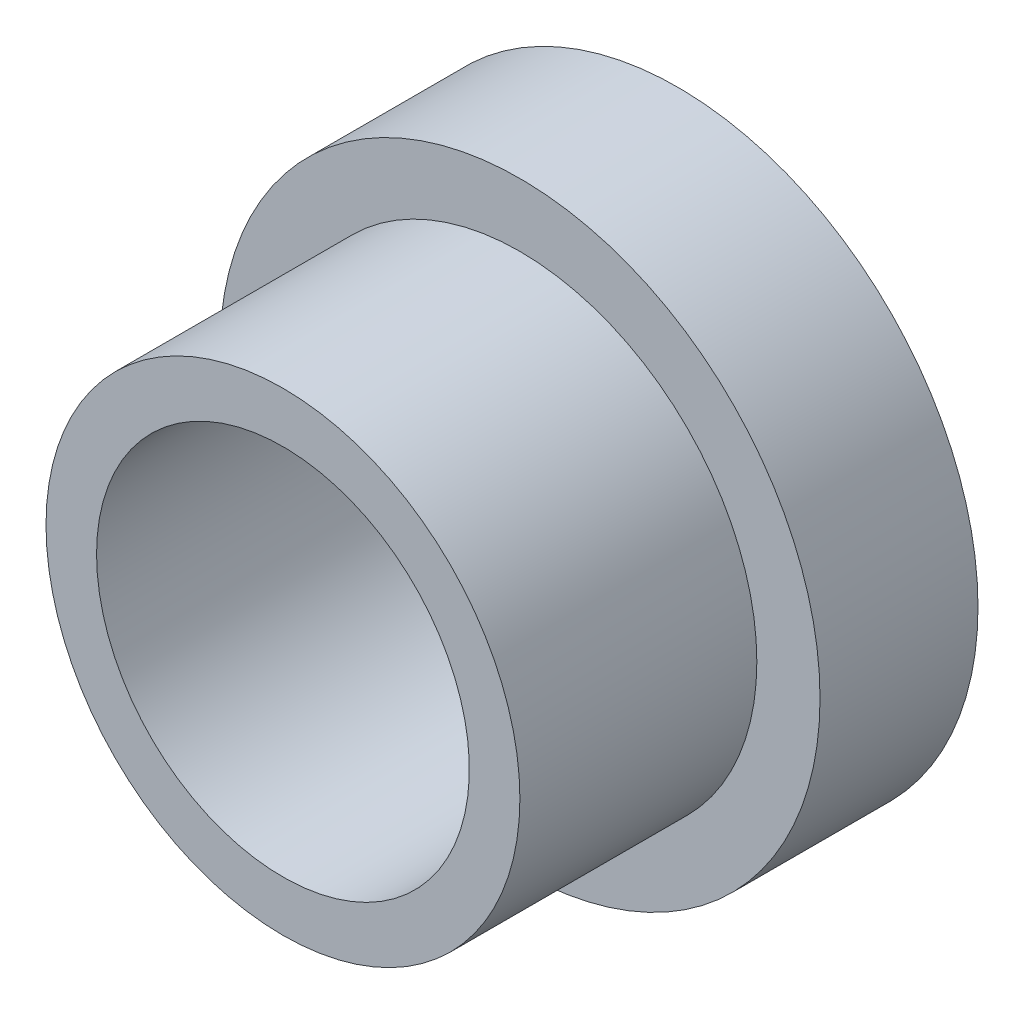
ISO-10303-21;
HEADER;
FILE_DESCRIPTION(('STEP AP214'),'2;1');
FILE_NAME('part.step','',(''),(''),'','','');
FILE_SCHEMA(('AUTOMOTIVE_DESIGN { 1 0 10303 214 1 1 1 1 }'));
ENDSEC;
DATA;
#1=APPLICATION_CONTEXT('core data for automotive mechanical design processes');
#2=APPLICATION_PROTOCOL_DEFINITION('international standard','automotive_design',2000,#1);
#3=PRODUCT_CONTEXT('',#1,'mechanical');
#4=PRODUCT('Part','Part','',(#3));
#5=PRODUCT_RELATED_PRODUCT_CATEGORY('part','',(#4));
#6=PRODUCT_DEFINITION_FORMATION('','',#4);
#7=PRODUCT_DEFINITION_CONTEXT('part definition',#1,'design');
#8=PRODUCT_DEFINITION('design','',#6,#7);
#9=PRODUCT_DEFINITION_SHAPE('','',#8);
#10=(LENGTH_UNIT() NAMED_UNIT(*) SI_UNIT(.MILLI.,.METRE.));
#11=(NAMED_UNIT(*) PLANE_ANGLE_UNIT() SI_UNIT($,.RADIAN.));
#12=(NAMED_UNIT(*) SI_UNIT($,.STERADIAN.) SOLID_ANGLE_UNIT());
#13=UNCERTAINTY_MEASURE_WITH_UNIT(LENGTH_MEASURE(1.E-05),#10,'distance_accuracy_value','');
#14=(GEOMETRIC_REPRESENTATION_CONTEXT(3) GLOBAL_UNCERTAINTY_ASSIGNED_CONTEXT((#13)) GLOBAL_UNIT_ASSIGNED_CONTEXT((#10,
#11,#12)) REPRESENTATION_CONTEXT('',''));
#15=CARTESIAN_POINT('',(0.,0.,0.));
#16=DIRECTION('',(0.,0.,1.));
#17=DIRECTION('',(1.,0.,0.));
#18=AXIS2_PLACEMENT_3D('',#15,#16,#17);
#19=CARTESIAN_POINT('',(0.,0.,6.35));
#20=DIRECTION('',(0.,0.,1.));
#21=DIRECTION('',(1.,0.,0.));
#22=AXIS2_PLACEMENT_3D('',#19,#20,#21);
#23=PLANE('',#22);
#24=CARTESIAN_POINT('',(0.,0.,6.35));
#25=DIRECTION('',(0.,0.,1.));
#26=DIRECTION('',(1.,0.,0.));
#27=AXIS2_PLACEMENT_3D('',#24,#25,#26);
#28=CIRCLE('',#27,12.065);
#29=CARTESIAN_POINT('',(12.065,0.,6.35));
#30=VERTEX_POINT('',#29);
#31=EDGE_CURVE('E10',#30,#30,#28,.T.);
#32=ORIENTED_EDGE('',*,*,#31,.T.);
#33=EDGE_LOOP('',(#32));
#34=FACE_BOUND('',#33,.T.);
#35=CARTESIAN_POINT('',(0.,0.,6.35));
#36=DIRECTION('',(0.,0.,1.));
#37=DIRECTION('',(1.,0.,0.));
#38=AXIS2_PLACEMENT_3D('',#35,#36,#37);
#39=CIRCLE('',#38,9.525);
#40=CARTESIAN_POINT('',(9.525,0.,6.35));
#41=VERTEX_POINT('',#40);
#42=EDGE_CURVE('E58',#41,#41,#39,.T.);
#43=ORIENTED_EDGE('',*,*,#42,.F.);
#44=EDGE_LOOP('',(#43));
#45=FACE_BOUND('',#44,.T.);
#46=ADVANCED_FACE('F37',(#34,#45),#23,.T.);
#47=CARTESIAN_POINT('',(0.,0.,6.35));
#48=DIRECTION('',(0.,0.,-1.));
#49=DIRECTION('',(-1.,0.,0.));
#50=AXIS2_PLACEMENT_3D('',#47,#48,#49);
#51=CYLINDRICAL_SURFACE('',#50,12.065);
#52=CARTESIAN_POINT('',(-12.065,0.,1.4478));
#53=CARTESIAN_POINT('',(-12.0649985041005,0.0964884543450404,1.44780401682392));
#54=CARTESIAN_POINT('',(-12.0638303589616,0.193034155145278,1.45591264605277));
#55=CARTESIAN_POINT('',(-12.0592828021006,0.38343047278372,1.4881267082203));
#56=CARTESIAN_POINT('',(-12.0559011918848,0.477278313162616,1.51224804589987));
#57=CARTESIAN_POINT('',(-12.0473069959825,0.65949565450108,1.57575497131468));
#58=CARTESIAN_POINT('',(-12.0420957506089,0.747869110160845,1.61512938747027));
#59=CARTESIAN_POINT('',(-12.0304192156495,0.916739911937079,1.70799827245479));
#60=CARTESIAN_POINT('',(-12.0239541121138,0.99723842389159,1.76149064685575));
#61=CARTESIAN_POINT('',(-12.0104380083644,1.14866365986144,1.8814844220945));
#62=CARTESIAN_POINT('',(-12.0033835313217,1.21952599782181,1.94806669129644));
#63=CARTESIAN_POINT('',(-11.9895112125531,1.34911212744686,2.09217627787022));
#64=CARTESIAN_POINT('',(-11.9826933839829,1.40783524516034,2.16970420252643));
#65=CARTESIAN_POINT('',(-11.970032472617,1.51172365726895,2.33393306104171));
#66=CARTESIAN_POINT('',(-11.9641938809672,1.55682720468731,2.42067343120915));
#67=CARTESIAN_POINT('',(-11.9541995874195,1.63180163908825,2.60059579968724));
#68=CARTESIAN_POINT('',(-11.950043802025,1.66167328185876,2.6937774781277));
#69=CARTESIAN_POINT('',(-11.943919604014,1.70513718284501,2.88326256195756));
#70=CARTESIAN_POINT('',(-11.9419364406316,1.71883927207584,2.97954028907811));
#71=CARTESIAN_POINT('',(-11.9403371589043,1.7299152479595,3.17304739966861));
#72=CARTESIAN_POINT('',(-11.9407209165818,1.72728998982615,3.27027673302782));
#73=CARTESIAN_POINT('',(-11.9437986235095,1.70587566350776,3.4621542738988));
#74=CARTESIAN_POINT('',(-11.9464751455298,1.68720852572685,3.55681640898697));
#75=CARTESIAN_POINT('',(-11.9538095965803,1.63443101834743,3.74165082781202));
#76=CARTESIAN_POINT('',(-11.9584675770697,1.60032024767048,3.83182299487481));
#77=CARTESIAN_POINT('',(-11.9692595113069,1.51749570954079,4.00549107394876));
#78=CARTESIAN_POINT('',(-11.9753987087908,1.46872990694117,4.08896183054549));
#79=CARTESIAN_POINT('',(-11.9884574849056,1.35801669179577,4.2465816785898));
#80=CARTESIAN_POINT('',(-11.9953771102361,1.29606849023947,4.32073021164844));
#81=CARTESIAN_POINT('',(-12.0092942198149,1.16007778385262,4.4583077862522));
#82=CARTESIAN_POINT('',(-12.0162918396414,1.08593036818556,4.52163315932482));
#83=CARTESIAN_POINT('',(-12.0295178957284,0.928004629275646,4.63495644124068));
#84=CARTESIAN_POINT('',(-12.0357463291408,0.844226270375422,4.68495430073819));
#85=CARTESIAN_POINT('',(-12.0467379261181,0.669329836206021,4.77020709183091));
#86=CARTESIAN_POINT('',(-12.0515003380949,0.578208026258997,4.80545446458137));
#87=CARTESIAN_POINT('',(-12.0590168850682,0.391255347913628,4.86011790324658));
#88=CARTESIAN_POINT('',(-12.0617711436242,0.295424769628157,4.87953494319366));
#89=CARTESIAN_POINT('',(-12.0649447800063,0.102670036805973,4.90184970451336));
#90=CARTESIAN_POINT('',(-12.0653843132238,0.00576271069349187,4.90489003088116));
#91=CARTESIAN_POINT('',(-12.0639337107159,-0.18717853030849,4.89474294385951));
#92=CARTESIAN_POINT('',(-12.0620436405075,-0.28321246968425,4.88155598683962));
#93=CARTESIAN_POINT('',(-12.0561586805947,-0.471252184740598,4.83944721921327));
#94=CARTESIAN_POINT('',(-12.0521730294487,-0.563273736163867,4.8105944546433));
#95=CARTESIAN_POINT('',(-12.0425425508097,-0.741172931556662,4.73804560812774));
#96=CARTESIAN_POINT('',(-12.0368976514939,-0.827050309367008,4.69434888362805));
#97=CARTESIAN_POINT('',(-12.0245263853715,-0.990853356151727,4.5930149061261));
#98=CARTESIAN_POINT('',(-12.0177930606412,-1.06872220577748,4.53528667128957));
#99=CARTESIAN_POINT('',(-12.0040172458003,-1.2137171924543,4.40765562531037));
#100=CARTESIAN_POINT('',(-11.9969747394169,-1.28084276320418,4.33775217279128));
#101=CARTESIAN_POINT('',(-11.9833108785997,-1.40296089013384,4.18712203681459));
#102=CARTESIAN_POINT('',(-11.9766930997437,-1.45785815430897,4.10631772561116));
#103=CARTESIAN_POINT('',(-11.9646900187645,-1.55330015810762,3.93655113452041));
#104=CARTESIAN_POINT('',(-11.9593046857287,-1.59384525773093,3.8475890593273));
#105=CARTESIAN_POINT('',(-11.9504017224073,-1.65928238165809,3.66432316993253));
#106=CARTESIAN_POINT('',(-11.9468779906908,-1.68422559150998,3.57003794145217));
#107=CARTESIAN_POINT('',(-11.9420806193532,-1.71791440391797,3.37856276993285));
#108=CARTESIAN_POINT('',(-11.940806839334,-1.72666101715085,3.28137300852297));
#109=CARTESIAN_POINT('',(-11.9406585128162,-1.72768590402545,3.0877968638374));
#110=CARTESIAN_POINT('',(-11.9417621443008,-1.72011396371325,2.99141125664726));
#111=CARTESIAN_POINT('',(-11.9461970132462,-1.6890365616241,2.80129882275977));
#112=CARTESIAN_POINT('',(-11.9495282483612,-1.66553111662558,2.70757199326276));
#113=CARTESIAN_POINT('',(-11.9580356047218,-1.60330516262919,2.52547288587834));
#114=CARTESIAN_POINT('',(-11.9632105698968,-1.5645941863711,2.43709729314934));
#115=CARTESIAN_POINT('',(-11.9748238370226,-1.47307082901084,2.26807122174957));
#116=CARTESIAN_POINT('',(-11.9812621740083,-1.42025805683243,2.18742095740478));
#117=CARTESIAN_POINT('',(-11.9947472532479,-1.30148257030631,2.03537241681569));
#118=CARTESIAN_POINT('',(-12.0017988325567,-1.23540867850348,1.9640614089024));
#119=CARTESIAN_POINT('',(-12.0156747903311,-1.09222118229823,1.83348514565739));
#120=CARTESIAN_POINT('',(-12.0224991154125,-1.01510500619472,1.7742227041876));
#121=CARTESIAN_POINT('',(-12.0351902736848,-0.851571550996564,1.66916444703717));
#122=CARTESIAN_POINT('',(-12.0410521560854,-0.765109754814756,1.62343734629982));
#123=CARTESIAN_POINT('',(-12.0511090894658,-0.585692447555416,1.54722108641448));
#124=CARTESIAN_POINT('',(-12.0553058907113,-0.492743876652405,1.51671591784832));
#125=CARTESIAN_POINT('',(-12.0605860358316,-0.332799090104946,1.47884198403685));
#126=CARTESIAN_POINT('',(-12.062232900176,-0.26679682861633,1.46721871619034));
#127=CARTESIAN_POINT('',(-12.0644403953593,-0.133872225166998,1.45169637239414));
#128=CARTESIAN_POINT('',(-12.0650010379513,-0.0669498931693692,1.44779721286931));
#129=CARTESIAN_POINT('',(-12.065,0.,1.4478));
#130=B_SPLINE_CURVE_WITH_KNOTS('',3,(#52,#53,#54,#55,#56,#57,#58,#59,#60,#61,#62,#63,#64,#65,
#66,#67,#68,#69,#70,#71,#72,#73,#74,#75,#76,#77,#78,#79,#80,#81,#82,#83,#84,#85,#86,#87,#88,#89,
#90,#91,#92,#93,#94,#95,#96,#97,#98,#99,#100,#101,#102,#103,#104,#105,#106,#107,#108,#109,#110,
#111,#112,#113,#114,#115,#116,#117,#118,#119,#120,#121,#122,#123,#124,#125,#126,#127,#128,#129),
.UNSPECIFIED.,.T.,.F.,(4,2,2,2,2,2,2,2,2,2,2,2,2,2,2,2,2,2,2,2,2,2,2,2,2,2,2,2,2,2,2,2,2,2,2,2,
2,2,4),(0.,0.289220749432823,0.578729200194767,0.868026010375867,1.15727992688445,
1.44838041330317,1.73949705684387,2.03191437504971,2.32431718246423,2.61472220997412,
2.90511202642148,3.19331398780884,3.48152343436625,3.77076855672439,4.0600309962394,
4.35192526520652,4.64382061491082,4.93586536292638,5.22789214022055,5.51737184883535,
5.8068434164259,6.09504939247946,6.38326784576508,6.67340747608099,6.96356239524336,
7.25590492530746,7.54824012193353,7.83961114565159,8.13096398704053,8.41965393294043,
8.7083435748419,8.99685251788698,9.2853694628003,9.57641468202267,9.86752779502192,
10.1600944081533,10.4523526671518,10.6530347894157,10.8537147402796),.UNSPECIFIED.);
#131=CARTESIAN_POINT('',(-12.065,0.,1.4478));
#132=VERTEX_POINT('',#131);
#133=EDGE_CURVE('E68',#132,#132,#130,.T.);
#134=ORIENTED_EDGE('',*,*,#133,.T.);
#135=EDGE_LOOP('',(#134));
#136=FACE_BOUND('',#135,.T.);
#137=ORIENTED_EDGE('',*,*,#31,.F.);
#138=EDGE_LOOP('',(#137));
#139=FACE_BOUND('',#138,.T.);
#140=CARTESIAN_POINT('',(0.,0.,0.));
#141=DIRECTION('',(0.,0.,1.));
#142=DIRECTION('',(1.,0.,0.));
#143=AXIS2_PLACEMENT_3D('',#140,#141,#142);
#144=CIRCLE('',#143,12.065);
#145=CARTESIAN_POINT('',(12.065,0.,0.));
#146=VERTEX_POINT('',#145);
#147=EDGE_CURVE('E50',#146,#146,#144,.T.);
#148=ORIENTED_EDGE('',*,*,#147,.T.);
#149=EDGE_LOOP('',(#148));
#150=FACE_BOUND('',#149,.T.);
#151=ADVANCED_FACE('F39',(#136,#139,#150),#51,.T.);
#152=CARTESIAN_POINT('',(0.,0.,0.));
#153=DIRECTION('',(0.,0.,1.));
#154=DIRECTION('',(1.,0.,0.));
#155=AXIS2_PLACEMENT_3D('',#152,#153,#154);
#156=PLANE('',#155);
#157=CARTESIAN_POINT('',(0.,0.,0.));
#158=DIRECTION('',(0.,0.,-1.));
#159=DIRECTION('',(-1.,0.,0.));
#160=AXIS2_PLACEMENT_3D('',#157,#158,#159);
#161=CIRCLE('',#160,7.493);
#162=CARTESIAN_POINT('',(-7.493,0.,0.));
#163=VERTEX_POINT('',#162);
#164=EDGE_CURVE('E64',#163,#163,#161,.T.);
#165=ORIENTED_EDGE('',*,*,#164,.F.);
#166=EDGE_LOOP('',(#165));
#167=FACE_BOUND('',#166,.T.);
#168=ORIENTED_EDGE('',*,*,#147,.F.);
#169=EDGE_LOOP('',(#168));
#170=FACE_BOUND('',#169,.T.);
#171=ADVANCED_FACE('F92',(#167,#170),#156,.F.);
#172=CARTESIAN_POINT('',(0.,0.,15.875));
#173=DIRECTION('',(0.,0.,-1.));
#174=DIRECTION('',(-1.,0.,0.));
#175=AXIS2_PLACEMENT_3D('',#172,#173,#174);
#176=CYLINDRICAL_SURFACE('',#175,9.525);
#177=CARTESIAN_POINT('',(0.,0.,15.875));
#178=DIRECTION('',(0.,0.,1.));
#179=DIRECTION('',(1.,0.,0.));
#180=AXIS2_PLACEMENT_3D('',#177,#178,#179);
#181=CIRCLE('',#180,9.525);
#182=CARTESIAN_POINT('',(9.525,0.,15.875));
#183=VERTEX_POINT('',#182);
#184=EDGE_CURVE('E56',#183,#183,#181,.T.);
#185=ORIENTED_EDGE('',*,*,#184,.F.);
#186=EDGE_LOOP('',(#185));
#187=FACE_BOUND('',#186,.T.);
#188=ORIENTED_EDGE('',*,*,#42,.T.);
#189=EDGE_LOOP('',(#188));
#190=FACE_BOUND('',#189,.T.);
#191=ADVANCED_FACE('F88',(#187,#190),#176,.T.);
#192=CARTESIAN_POINT('',(0.,0.,15.875));
#193=DIRECTION('',(0.,0.,1.));
#194=DIRECTION('',(1.,0.,0.));
#195=AXIS2_PLACEMENT_3D('',#192,#193,#194);
#196=PLANE('',#195);
#197=CARTESIAN_POINT('',(0.,0.,15.875));
#198=DIRECTION('',(0.,0.,-1.));
#199=DIRECTION('',(-1.,0.,0.));
#200=AXIS2_PLACEMENT_3D('',#197,#198,#199);
#201=CIRCLE('',#200,7.493);
#202=CARTESIAN_POINT('',(-7.493,0.,15.875));
#203=VERTEX_POINT('',#202);
#204=EDGE_CURVE('E61',#203,#203,#201,.T.);
#205=ORIENTED_EDGE('',*,*,#204,.T.);
#206=EDGE_LOOP('',(#205));
#207=FACE_BOUND('',#206,.T.);
#208=ORIENTED_EDGE('',*,*,#184,.T.);
#209=EDGE_LOOP('',(#208));
#210=FACE_BOUND('',#209,.T.);
#211=ADVANCED_FACE('F84',(#207,#210),#196,.T.);
#212=CARTESIAN_POINT('',(0.,0.,15.875));
#213=DIRECTION('',(0.,0.,-1.));
#214=DIRECTION('',(-1.,0.,0.));
#215=AXIS2_PLACEMENT_3D('',#212,#213,#214);
#216=CYLINDRICAL_SURFACE('',#215,7.493);
#217=CARTESIAN_POINT('',(-7.493,0.,4.9022));
#218=CARTESIAN_POINT('',(-7.49299826637144,0.0956624507880844,4.90219692622512));
#219=CARTESIAN_POINT('',(-7.49114954278737,0.191360972980343,4.8942256755257));
#220=CARTESIAN_POINT('',(-7.48395337552565,0.380030846325658,4.86258966468595));
#221=CARTESIAN_POINT('',(-7.47860361941316,0.473000352525537,4.83891453197842));
#222=CARTESIAN_POINT('',(-7.46499986969367,0.653459039138596,4.77665871197471));
#223=CARTESIAN_POINT('',(-7.45674907701501,0.740954135044134,4.73809444837824));
#224=CARTESIAN_POINT('',(-7.43822945369063,0.908230684834334,4.64720929093241));
#225=CARTESIAN_POINT('',(-7.42796063081788,0.988012168428256,4.59488845006991));
#226=CARTESIAN_POINT('',(-7.40632294003493,1.13901125174032,4.4769956382771));
#227=CARTESIAN_POINT('',(-7.39493919378767,1.21007275023594,4.41122644601544));
#228=CARTESIAN_POINT('',(-7.37245729535181,1.34025996097252,4.26872686303956));
#229=CARTESIAN_POINT('',(-7.36135917103644,1.39938451213719,4.19199540729238));
#230=CARTESIAN_POINT('',(-7.34055726673632,1.50472460146197,4.02857429128956));
#231=CARTESIAN_POINT('',(-7.33087249118105,1.55077090702364,3.94177290839061));
#232=CARTESIAN_POINT('',(-7.3142086947934,1.62756089890498,3.76140346308332));
#233=CARTESIAN_POINT('',(-7.30722931167091,1.65830663434294,3.66783630869959));
#234=CARTESIAN_POINT('',(-7.29691859923342,1.70310077522002,3.47829335881457));
#235=CARTESIAN_POINT('',(-7.29352661481694,1.71742715664648,3.38238662885948));
#236=CARTESIAN_POINT('',(-7.29059281452551,1.72984082119943,3.1894756023355));
#237=CARTESIAN_POINT('',(-7.29105047081323,1.7279303306183,3.09247145805824));
#238=CARTESIAN_POINT('',(-7.29570946838221,1.70814748514194,2.90220845045119));
#239=CARTESIAN_POINT('',(-7.29983437541997,1.69060100426086,2.80891354555136));
#240=CARTESIAN_POINT('',(-7.31124190966975,1.64056182698234,2.62662838982441));
#241=CARTESIAN_POINT('',(-7.31852473149659,1.60806820942076,2.53763840467506));
#242=CARTESIAN_POINT('',(-7.33550094134328,1.5287657921493,2.36558845887287));
#243=CARTESIAN_POINT('',(-7.3452148587261,1.48183425550443,2.28258718119328));
#244=CARTESIAN_POINT('',(-7.36594652645374,1.3750743360317,2.12551872785821));
#245=CARTESIAN_POINT('',(-7.37696447288745,1.31524401247897,2.05145289923016));
#246=CARTESIAN_POINT('',(-7.39938850995993,1.18267323977965,1.91248467175857));
#247=CARTESIAN_POINT('',(-7.41079755579355,1.10965642440694,1.84784610720416));
#248=CARTESIAN_POINT('',(-7.43247735691869,0.953686946749391,1.73168579286961));
#249=CARTESIAN_POINT('',(-7.44274808691628,0.870734063765591,1.68016433452484));
#250=CARTESIAN_POINT('',(-7.46103338328835,0.696905527581812,1.59162424917043));
#251=CARTESIAN_POINT('',(-7.46904209194807,0.606010088235587,1.5546431806041));
#252=CARTESIAN_POINT('',(-7.48185786620484,0.419068663184981,1.49655508019318));
#253=CARTESIAN_POINT('',(-7.48666545015561,0.323023514088963,1.47544547823231));
#254=CARTESIAN_POINT('',(-7.49246244502474,0.130769429010594,1.45009019708531));
#255=CARTESIAN_POINT('',(-7.49353334634695,0.0346103602861611,1.44548453512156));
#256=CARTESIAN_POINT('',(-7.49196602594644,-0.157103475340125,1.45228795253745));
#257=CARTESIAN_POINT('',(-7.48932808524433,-0.252658287475725,1.46369581856484));
#258=CARTESIAN_POINT('',(-7.48069120631157,-0.439237341815207,1.50190451015535));
#259=CARTESIAN_POINT('',(-7.4747341170137,-0.530302923161973,1.52851377513747));
#260=CARTESIAN_POINT('',(-7.46012703712701,-0.706676587306445,1.59615507115172));
#261=CARTESIAN_POINT('',(-7.45147680043301,-0.791984143057007,1.63718842032975));
#262=CARTESIAN_POINT('',(-7.43224380660875,-0.955888492203061,1.73324403063954));
#263=CARTESIAN_POINT('',(-7.42163304911813,-1.03436007301081,1.78847421314953));
#264=CARTESIAN_POINT('',(-7.39970810447471,-1.18105014037366,1.91108489010039));
#265=CARTESIAN_POINT('',(-7.38839381528406,-1.24926713471164,1.97846714974351));
#266=CARTESIAN_POINT('',(-7.36605113093878,-1.37495701685672,2.12512888615341));
#267=CARTESIAN_POINT('',(-7.35503344172746,-1.43217935370056,2.20462503545739));
#268=CARTESIAN_POINT('',(-7.33479570823384,-1.53246489996075,2.37230874767979));
#269=CARTESIAN_POINT('',(-7.32557558405261,-1.57552873875843,2.46049592403335));
#270=CARTESIAN_POINT('',(-7.31007070235848,-1.64596993733039,2.64257745694784));
#271=CARTESIAN_POINT('',(-7.303768934172,-1.67343841788725,2.73643504040198));
#272=CARTESIAN_POINT('',(-7.29478801361803,-1.71216803821831,2.92759973763412));
#273=CARTESIAN_POINT('',(-7.29210820709809,-1.72343210465054,3.02490622525637));
#274=CARTESIAN_POINT('',(-7.29071904188139,-1.7292980512995,3.21767234400098));
#275=CARTESIAN_POINT('',(-7.29191476445499,-1.72429825208708,3.31311938078064));
#276=CARTESIAN_POINT('',(-7.29792552611689,-1.69867652483642,3.50177096818557));
#277=CARTESIAN_POINT('',(-7.30274051238191,-1.67805482480029,3.59497555151904));
#278=CARTESIAN_POINT('',(-7.31539853248509,-1.62197653117616,3.77613783921894));
#279=CARTESIAN_POINT('',(-7.32322848057754,-1.58658399209314,3.86411634721052));
#280=CARTESIAN_POINT('',(-7.34103800230452,-1.50202160372936,4.03294371435135));
#281=CARTESIAN_POINT('',(-7.3510178277788,-1.45285014016237,4.11379173666009));
#282=CARTESIAN_POINT('',(-7.37228151507243,-1.34083088098955,4.26801291510486));
#283=CARTESIAN_POINT('',(-7.38358954520236,-1.27770187128868,4.34117851598213));
#284=CARTESIAN_POINT('',(-7.4060800026986,-1.14012166642034,4.47600787767522));
#285=CARTESIAN_POINT('',(-7.41726240019945,-1.06566783780914,4.53766895581429));
#286=CARTESIAN_POINT('',(-7.43843794089343,-0.906225807337194,4.64861679255472));
#287=CARTESIAN_POINT('',(-7.44841109269162,-0.821098328413016,4.69770745575846));
#288=CARTESIAN_POINT('',(-7.46584056203277,-0.643583763242079,4.78080429117608));
#289=CARTESIAN_POINT('',(-7.47329888003674,-0.551202519575783,4.81482245982159));
#290=CARTESIAN_POINT('',(-7.48360898426233,-0.382346474980722,4.86110760811602));
#291=CARTESIAN_POINT('',(-7.48710796169319,-0.306748722503182,4.87648648601794));
#292=CARTESIAN_POINT('',(-7.49180410544182,-0.154108397674637,4.89703364315616));
#293=CARTESIAN_POINT('',(-7.4930013966154,-0.0770659039230949,4.90220247624054));
#294=CARTESIAN_POINT('',(-7.493,0.,4.9022));
#295=B_SPLINE_CURVE_WITH_KNOTS('',3,(#217,#218,#219,#220,#221,#222,#223,#224,#225,#226,#227,
#228,#229,#230,#231,#232,#233,#234,#235,#236,#237,#238,#239,#240,#241,#242,#243,#244,#245,#246,
#247,#248,#249,#250,#251,#252,#253,#254,#255,#256,#257,#258,#259,#260,#261,#262,#263,#264,#265,
#266,#267,#268,#269,#270,#271,#272,#273,#274,#275,#276,#277,#278,#279,#280,#281,#282,#283,#284,
#285,#286,#287,#288,#289,#290,#291,#292,#293,#294),.UNSPECIFIED.,.T.,.F.,(4,2,2,2,2,2,2,2,2,2,2,
2,2,2,2,2,2,2,2,2,2,2,2,2,2,2,2,2,2,2,2,2,2,2,2,2,2,2,4),(0.,0.286705145260575,
0.573599850889571,0.860178992620656,1.14675703053772,1.43788561520468,1.7290425035754,
2.02381115199647,2.31854031309889,2.60820243677371,2.89782484453703,3.18154876146719,
3.46529016611589,3.75151362450977,4.03778017758694,4.33094524779538,4.62411683096575,
4.91804079054035,5.21191714383046,5.49934308944523,5.78674725784171,6.07060716324117,
6.35449301594399,6.64280034546465,6.93114958808818,7.22544464919714,7.51972662637116,
7.81227099027004,8.10476251147819,8.39014502279804,8.6755233690321,8.95967680935371,
9.24386355393653,9.53440460388482,9.82501331906835,10.1199117691169,10.4145750814349,
10.6455579765785,10.8765283416161),.UNSPECIFIED.);
#296=CARTESIAN_POINT('',(-7.493,0.,4.9022));
#297=VERTEX_POINT('',#296);
#298=EDGE_CURVE('E42',#297,#297,#295,.T.);
#299=ORIENTED_EDGE('',*,*,#298,.T.);
#300=EDGE_LOOP('',(#299));
#301=FACE_BOUND('',#300,.T.);
#302=ORIENTED_EDGE('',*,*,#204,.F.);
#303=EDGE_LOOP('',(#302));
#304=FACE_BOUND('',#303,.T.);
#305=ORIENTED_EDGE('',*,*,#164,.T.);
#306=EDGE_LOOP('',(#305));
#307=FACE_BOUND('',#306,.T.);
#308=ADVANCED_FACE('F78',(#301,#304,#307),#216,.F.);
#309=CARTESIAN_POINT('',(-12.065,0.,3.175));
#310=DIRECTION('',(1.,0.,0.));
#311=DIRECTION('',(0.,0.,-1.));
#312=AXIS2_PLACEMENT_3D('',#309,#310,#311);
#313=CYLINDRICAL_SURFACE('',#312,1.7272);
#314=ORIENTED_EDGE('',*,*,#298,.F.);
#315=EDGE_LOOP('',(#314));
#316=FACE_BOUND('',#315,.T.);
#317=ORIENTED_EDGE('',*,*,#133,.F.);
#318=EDGE_LOOP('',(#317));
#319=FACE_BOUND('',#318,.T.);
#320=ADVANCED_FACE('F75',(#316,#319),#313,.F.);
#321=CLOSED_SHELL('',(#46,#151,#171,#191,#211,#308,#320));
#322=MANIFOLD_SOLID_BREP('B2',#321);
#323=ADVANCED_BREP_SHAPE_REPRESENTATION('',(#18,#322),#14);
#324=SHAPE_DEFINITION_REPRESENTATION(#9,#323);
ENDSEC;
END-ISO-10303-21;
